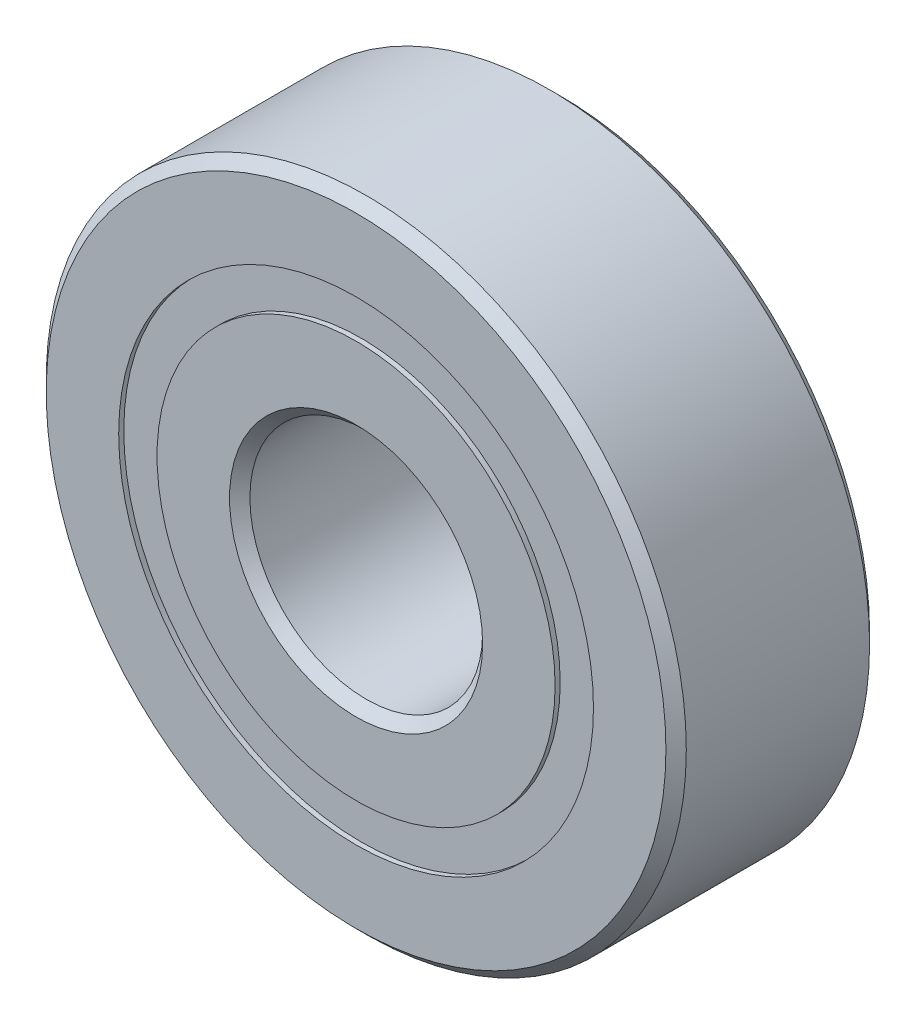
ISO-10303-21;
HEADER;
FILE_DESCRIPTION(('STEP AP214'),'2;1');
FILE_NAME('part.step','',(''),(''),'','','');
FILE_SCHEMA(('AUTOMOTIVE_DESIGN { 1 0 10303 214 1 1 1 1 }'));
ENDSEC;
DATA;
#1=APPLICATION_CONTEXT('core data for automotive mechanical design processes');
#2=APPLICATION_PROTOCOL_DEFINITION('international standard','automotive_design',2000,#1);
#3=PRODUCT_CONTEXT('',#1,'mechanical');
#4=PRODUCT('Part','Part','',(#3));
#5=PRODUCT_RELATED_PRODUCT_CATEGORY('part','',(#4));
#6=PRODUCT_DEFINITION_FORMATION('','',#4);
#7=PRODUCT_DEFINITION_CONTEXT('part definition',#1,'design');
#8=PRODUCT_DEFINITION('design','',#6,#7);
#9=PRODUCT_DEFINITION_SHAPE('','',#8);
#10=(LENGTH_UNIT() NAMED_UNIT(*) SI_UNIT(.MILLI.,.METRE.));
#11=(NAMED_UNIT(*) PLANE_ANGLE_UNIT() SI_UNIT($,.RADIAN.));
#12=(NAMED_UNIT(*) SI_UNIT($,.STERADIAN.) SOLID_ANGLE_UNIT());
#13=UNCERTAINTY_MEASURE_WITH_UNIT(LENGTH_MEASURE(1.E-05),#10,'distance_accuracy_value','');
#14=(GEOMETRIC_REPRESENTATION_CONTEXT(3) GLOBAL_UNCERTAINTY_ASSIGNED_CONTEXT((#13)) GLOBAL_UNIT_ASSIGNED_CONTEXT((#10,
#11,#12)) REPRESENTATION_CONTEXT('',''));
#15=CARTESIAN_POINT('',(0.,0.,0.));
#16=DIRECTION('',(0.,0.,1.));
#17=DIRECTION('',(1.,0.,0.));
#18=AXIS2_PLACEMENT_3D('',#15,#16,#17);
#19=CARTESIAN_POINT('',(0.,8.15934065934066,-3.325));
#20=DIRECTION('',(0.,0.,1.));
#21=DIRECTION('',(1.,0.,0.));
#22=AXIS2_PLACEMENT_3D('',#19,#20,#21);
#23=PLANE('',#22);
#24=CARTESIAN_POINT('',(0.,0.,-3.325));
#25=DIRECTION('',(0.,0.,1.));
#26=DIRECTION('',(1.,0.,0.));
#27=AXIS2_PLACEMENT_3D('',#24,#25,#26);
#28=CIRCLE('',#27,8.15934065934066);
#29=CARTESIAN_POINT('',(8.15934065934066,0.,-3.325));
#30=VERTEX_POINT('',#29);
#31=EDGE_CURVE('E69',#30,#30,#28,.T.);
#32=ORIENTED_EDGE('',*,*,#31,.F.);
#33=EDGE_LOOP('',(#32));
#34=FACE_BOUND('',#33,.T.);
#35=CARTESIAN_POINT('',(0.,0.,-3.325));
#36=DIRECTION('',(0.,0.,1.));
#37=DIRECTION('',(1.,0.,0.));
#38=AXIS2_PLACEMENT_3D('',#35,#36,#37);
#39=CIRCLE('',#38,6.84065934065934);
#40=CARTESIAN_POINT('',(6.84065934065934,0.,-3.325));
#41=VERTEX_POINT('',#40);
#42=EDGE_CURVE('E13',#41,#41,#39,.T.);
#43=ORIENTED_EDGE('',*,*,#42,.T.);
#44=EDGE_LOOP('',(#43));
#45=FACE_BOUND('',#44,.T.);
#46=ADVANCED_FACE('F55',(#34,#45),#23,.F.);
#47=CARTESIAN_POINT('',(0.,0.,3.5));
#48=DIRECTION('',(0.,0.,1.));
#49=DIRECTION('',(1.,0.,0.));
#50=AXIS2_PLACEMENT_3D('',#47,#48,#49);
#51=CYLINDRICAL_SURFACE('',#50,6.84065934065934);
#52=ORIENTED_EDGE('',*,*,#42,.F.);
#53=EDGE_LOOP('',(#52));
#54=FACE_BOUND('',#53,.T.);
#55=CARTESIAN_POINT('',(0.,0.,-1.68952158656808));
#56=DIRECTION('',(0.,0.,1.));
#57=DIRECTION('',(1.,0.,0.));
#58=AXIS2_PLACEMENT_3D('',#55,#56,#57);
#59=CIRCLE('',#58,6.84065934065934);
#60=CARTESIAN_POINT('',(6.84065934065934,0.,-1.68952158656808));
#61=VERTEX_POINT('',#60);
#62=EDGE_CURVE('E61',#61,#61,#59,.T.);
#63=ORIENTED_EDGE('',*,*,#62,.T.);
#64=EDGE_LOOP('',(#63));
#65=FACE_BOUND('',#64,.T.);
#66=ADVANCED_FACE('F78',(#54,#65),#51,.F.);
#67=CARTESIAN_POINT('',(0.,8.15934065934066,-1.68952158656808));
#68=DIRECTION('',(0.,0.,-1.));
#69=DIRECTION('',(-1.,0.,0.));
#70=AXIS2_PLACEMENT_3D('',#67,#68,#69);
#71=PLANE('',#70);
#72=ORIENTED_EDGE('',*,*,#62,.F.);
#73=EDGE_LOOP('',(#72));
#74=FACE_BOUND('',#73,.T.);
#75=CARTESIAN_POINT('',(0.,0.,-1.68952158656808));
#76=DIRECTION('',(0.,0.,1.));
#77=DIRECTION('',(1.,0.,0.));
#78=AXIS2_PLACEMENT_3D('',#75,#76,#77);
#79=CIRCLE('',#78,8.15934065934066);
#80=CARTESIAN_POINT('',(8.15934065934066,0.,-1.68952158656808));
#81=VERTEX_POINT('',#80);
#82=EDGE_CURVE('E65',#81,#81,#79,.T.);
#83=ORIENTED_EDGE('',*,*,#82,.T.);
#84=EDGE_LOOP('',(#83));
#85=FACE_BOUND('',#84,.T.);
#86=ADVANCED_FACE('F82',(#74,#85),#71,.F.);
#87=CARTESIAN_POINT('',(0.,0.,3.5));
#88=DIRECTION('',(0.,0.,1.));
#89=DIRECTION('',(1.,0.,0.));
#90=AXIS2_PLACEMENT_3D('',#87,#88,#89);
#91=CYLINDRICAL_SURFACE('',#90,8.15934065934066);
#92=ORIENTED_EDGE('',*,*,#82,.F.);
#93=EDGE_LOOP('',(#92));
#94=FACE_BOUND('',#93,.T.);
#95=ORIENTED_EDGE('',*,*,#31,.T.);
#96=EDGE_LOOP('',(#95));
#97=FACE_BOUND('',#96,.T.);
#98=ADVANCED_FACE('F75',(#94,#97),#91,.T.);
#99=CLOSED_SHELL('',(#46,#66,#86,#98));
#100=MANIFOLD_SOLID_BREP('B2',#99);
#101=CARTESIAN_POINT('',(0.,8.15934065934066,3.325));
#102=DIRECTION('',(0.,0.,-1.));
#103=DIRECTION('',(-1.,0.,0.));
#104=AXIS2_PLACEMENT_3D('',#101,#102,#103);
#105=PLANE('',#104);
#106=CARTESIAN_POINT('',(0.,0.,3.325));
#107=DIRECTION('',(0.,0.,1.));
#108=DIRECTION('',(1.,0.,0.));
#109=AXIS2_PLACEMENT_3D('',#106,#107,#108);
#110=CIRCLE('',#109,6.84065934065934);
#111=CARTESIAN_POINT('',(6.84065934065934,0.,3.325));
#112=VERTEX_POINT('',#111);
#113=EDGE_CURVE('E54',#112,#112,#110,.T.);
#114=ORIENTED_EDGE('',*,*,#113,.F.);
#115=EDGE_LOOP('',(#114));
#116=FACE_BOUND('',#115,.T.);
#117=CARTESIAN_POINT('',(0.,0.,3.325));
#118=DIRECTION('',(0.,0.,1.));
#119=DIRECTION('',(1.,0.,0.));
#120=AXIS2_PLACEMENT_3D('',#117,#118,#119);
#121=CIRCLE('',#120,8.15934065934066);
#122=CARTESIAN_POINT('',(8.15934065934066,0.,3.325));
#123=VERTEX_POINT('',#122);
#124=EDGE_CURVE('E143',#123,#123,#121,.T.);
#125=ORIENTED_EDGE('',*,*,#124,.T.);
#126=EDGE_LOOP('',(#125));
#127=FACE_BOUND('',#126,.T.);
#128=ADVANCED_FACE('F129',(#116,#127),#105,.F.);
#129=CARTESIAN_POINT('',(0.,0.,3.5));
#130=DIRECTION('',(0.,0.,1.));
#131=DIRECTION('',(1.,0.,0.));
#132=AXIS2_PLACEMENT_3D('',#129,#130,#131);
#133=CYLINDRICAL_SURFACE('',#132,6.84065934065934);
#134=CARTESIAN_POINT('',(0.,0.,1.68952158656808));
#135=DIRECTION('',(0.,0.,1.));
#136=DIRECTION('',(1.,0.,0.));
#137=AXIS2_PLACEMENT_3D('',#134,#135,#136);
#138=CIRCLE('',#137,6.84065934065934);
#139=CARTESIAN_POINT('',(6.84065934065934,0.,1.68952158656808));
#140=VERTEX_POINT('',#139);
#141=EDGE_CURVE('E135',#140,#140,#138,.T.);
#142=ORIENTED_EDGE('',*,*,#141,.F.);
#143=EDGE_LOOP('',(#142));
#144=FACE_BOUND('',#143,.T.);
#145=ORIENTED_EDGE('',*,*,#113,.T.);
#146=EDGE_LOOP('',(#145));
#147=FACE_BOUND('',#146,.T.);
#148=ADVANCED_FACE('F158',(#144,#147),#133,.F.);
#149=CARTESIAN_POINT('',(0.,8.15934065934066,1.68952158656808));
#150=DIRECTION('',(0.,0.,1.));
#151=DIRECTION('',(1.,0.,0.));
#152=AXIS2_PLACEMENT_3D('',#149,#150,#151);
#153=PLANE('',#152);
#154=CARTESIAN_POINT('',(0.,0.,1.68952158656808));
#155=DIRECTION('',(0.,0.,1.));
#156=DIRECTION('',(1.,0.,0.));
#157=AXIS2_PLACEMENT_3D('',#154,#155,#156);
#158=CIRCLE('',#157,8.15934065934066);
#159=CARTESIAN_POINT('',(8.15934065934066,0.,1.68952158656808));
#160=VERTEX_POINT('',#159);
#161=EDGE_CURVE('E139',#160,#160,#158,.T.);
#162=ORIENTED_EDGE('',*,*,#161,.F.);
#163=EDGE_LOOP('',(#162));
#164=FACE_BOUND('',#163,.T.);
#165=ORIENTED_EDGE('',*,*,#141,.T.);
#166=EDGE_LOOP('',(#165));
#167=FACE_BOUND('',#166,.T.);
#168=ADVANCED_FACE('F153',(#164,#167),#153,.F.);
#169=CARTESIAN_POINT('',(0.,0.,3.5));
#170=DIRECTION('',(0.,0.,1.));
#171=DIRECTION('',(1.,0.,0.));
#172=AXIS2_PLACEMENT_3D('',#169,#170,#171);
#173=CYLINDRICAL_SURFACE('',#172,8.15934065934066);
#174=ORIENTED_EDGE('',*,*,#124,.F.);
#175=EDGE_LOOP('',(#174));
#176=FACE_BOUND('',#175,.T.);
#177=ORIENTED_EDGE('',*,*,#161,.T.);
#178=EDGE_LOOP('',(#177));
#179=FACE_BOUND('',#178,.T.);
#180=ADVANCED_FACE('F150',(#176,#179),#173,.T.);
#181=CLOSED_SHELL('',(#128,#148,#168,#180));
#182=MANIFOLD_SOLID_BREP('B8',#181);
#183=CARTESIAN_POINT('',(-3.74999999999992,6.49519052838334,0.));
#184=DIRECTION('',(0.,0.,1.));
#185=DIRECTION('',(-0.499999999999989,0.866025403784445,0.));
#186=AXIS2_PLACEMENT_3D('',#183,#184,#185);
#187=SPHERICAL_SURFACE('',#186,1.68952158656808);
#188=CARTESIAN_POINT('',(-3.74999999999992,6.49519052838334,1.68952158656808));
#189=VERTEX_POINT('',#188);
#190=VERTEX_LOOP('',#189);
#191=FACE_BOUND('',#190,.T.);
#192=ADVANCED_FACE('F200',(#191),#187,.T.);
#193=CLOSED_SHELL('',(#192));
#194=MANIFOLD_SOLID_BREP('B49',#193);
#195=CARTESIAN_POINT('',(-6.49519052838325,3.75000000000008,0.));
#196=DIRECTION('',(0.,0.,1.));
#197=DIRECTION('',(-0.866025403784433,0.50000000000001,0.));
#198=AXIS2_PLACEMENT_3D('',#195,#196,#197);
#199=SPHERICAL_SURFACE('',#198,1.68952158656808);
#200=CARTESIAN_POINT('',(-6.49519052838325,3.75000000000008,1.68952158656808));
#201=VERTEX_POINT('',#200);
#202=VERTEX_LOOP('',#201);
#203=FACE_BOUND('',#202,.T.);
#204=ADVANCED_FACE('F224',(#203),#199,.T.);
#205=CLOSED_SHELL('',(#204));
#206=MANIFOLD_SOLID_BREP('B125',#205);
#207=CARTESIAN_POINT('',(-7.5,0.,0.));
#208=DIRECTION('',(0.,0.,1.));
#209=DIRECTION('',(-1.,0.,0.));
#210=AXIS2_PLACEMENT_3D('',#207,#208,#209);
#211=SPHERICAL_SURFACE('',#210,1.68952158656808);
#212=CARTESIAN_POINT('',(-7.5,0.,1.68952158656808));
#213=VERTEX_POINT('',#212);
#214=VERTEX_LOOP('',#213);
#215=FACE_BOUND('',#214,.T.);
#216=ADVANCED_FACE('F249',(#215),#211,.T.);
#217=CLOSED_SHELL('',(#216));
#218=MANIFOLD_SOLID_BREP('B196',#217);
#219=CARTESIAN_POINT('',(-6.49519052838332,-3.74999999999994,0.));
#220=DIRECTION('',(0.,0.,1.));
#221=DIRECTION('',(-0.866025403784443,-0.499999999999992,0.));
#222=AXIS2_PLACEMENT_3D('',#219,#220,#221);
#223=SPHERICAL_SURFACE('',#222,1.68952158656808);
#224=CARTESIAN_POINT('',(-6.49519052838332,-3.74999999999994,1.68952158656808));
#225=VERTEX_POINT('',#224);
#226=VERTEX_LOOP('',#225);
#227=FACE_BOUND('',#226,.T.);
#228=ADVANCED_FACE('F273',(#227),#223,.T.);
#229=CLOSED_SHELL('',(#228));
#230=MANIFOLD_SOLID_BREP('B220',#229);
#231=CARTESIAN_POINT('',(-3.75000000000005,-6.49519052838326,0.));
#232=DIRECTION('',(0.,0.,1.));
#233=DIRECTION('',(-0.500000000000007,-0.866025403784435,0.));
#234=AXIS2_PLACEMENT_3D('',#231,#232,#233);
#235=SPHERICAL_SURFACE('',#234,1.68952158656808);
#236=CARTESIAN_POINT('',(-3.75000000000005,-6.49519052838326,1.68952158656808));
#237=VERTEX_POINT('',#236);
#238=VERTEX_LOOP('',#237);
#239=FACE_BOUND('',#238,.T.);
#240=ADVANCED_FACE('F297',(#239),#235,.T.);
#241=CLOSED_SHELL('',(#240));
#242=MANIFOLD_SOLID_BREP('B245',#241);
#243=CARTESIAN_POINT('',(0.,-7.5,0.));
#244=DIRECTION('',(0.,0.,1.));
#245=DIRECTION('',(0.,-1.,0.));
#246=AXIS2_PLACEMENT_3D('',#243,#244,#245);
#247=SPHERICAL_SURFACE('',#246,1.68952158656808);
#248=CARTESIAN_POINT('',(0.,-7.5,1.68952158656808));
#249=VERTEX_POINT('',#248);
#250=VERTEX_LOOP('',#249);
#251=FACE_BOUND('',#250,.T.);
#252=ADVANCED_FACE('F322',(#251),#247,.T.);
#253=CLOSED_SHELL('',(#252));
#254=MANIFOLD_SOLID_BREP('B269',#253);
#255=CARTESIAN_POINT('',(3.74999999999996,-6.49519052838331,0.));
#256=DIRECTION('',(0.,0.,1.));
#257=DIRECTION('',(0.499999999999995,-0.866025403784442,0.));
#258=AXIS2_PLACEMENT_3D('',#255,#256,#257);
#259=SPHERICAL_SURFACE('',#258,1.68952158656808);
#260=CARTESIAN_POINT('',(3.74999999999996,-6.49519052838331,1.68952158656808));
#261=VERTEX_POINT('',#260);
#262=VERTEX_LOOP('',#261);
#263=FACE_BOUND('',#262,.T.);
#264=ADVANCED_FACE('F347',(#263),#259,.T.);
#265=CLOSED_SHELL('',(#264));
#266=MANIFOLD_SOLID_BREP('B293',#265);
#267=CARTESIAN_POINT('',(6.49519052838327,-3.75000000000003,0.));
#268=DIRECTION('',(0.,0.,1.));
#269=DIRECTION('',(0.866025403784436,-0.500000000000004,0.));
#270=AXIS2_PLACEMENT_3D('',#267,#268,#269);
#271=SPHERICAL_SURFACE('',#270,1.68952158656808);
#272=CARTESIAN_POINT('',(6.49519052838327,-3.75000000000003,1.68952158656808));
#273=VERTEX_POINT('',#272);
#274=VERTEX_LOOP('',#273);
#275=FACE_BOUND('',#274,.T.);
#276=ADVANCED_FACE('F372',(#275),#271,.T.);
#277=CLOSED_SHELL('',(#276));
#278=MANIFOLD_SOLID_BREP('B318',#277);
#279=CARTESIAN_POINT('',(7.5,0.,0.));
#280=DIRECTION('',(0.,0.,1.));
#281=DIRECTION('',(1.,0.,0.));
#282=AXIS2_PLACEMENT_3D('',#279,#280,#281);
#283=SPHERICAL_SURFACE('',#282,1.68952158656808);
#284=CARTESIAN_POINT('',(7.5,0.,1.68952158656808));
#285=VERTEX_POINT('',#284);
#286=VERTEX_LOOP('',#285);
#287=FACE_BOUND('',#286,.T.);
#288=ADVANCED_FACE('F396',(#287),#283,.T.);
#289=CLOSED_SHELL('',(#288));
#290=MANIFOLD_SOLID_BREP('B343',#289);
#291=CARTESIAN_POINT('',(6.4951905283833,3.74999999999998,0.));
#292=DIRECTION('',(0.,0.,1.));
#293=DIRECTION('',(0.86602540378444,0.499999999999998,0.));
#294=AXIS2_PLACEMENT_3D('',#291,#292,#293);
#295=SPHERICAL_SURFACE('',#294,1.68952158656808);
#296=CARTESIAN_POINT('',(6.4951905283833,3.74999999999998,1.68952158656808));
#297=VERTEX_POINT('',#296);
#298=VERTEX_LOOP('',#297);
#299=FACE_BOUND('',#298,.T.);
#300=ADVANCED_FACE('F420',(#299),#295,.T.);
#301=CLOSED_SHELL('',(#300));
#302=MANIFOLD_SOLID_BREP('B368',#301);
#303=CARTESIAN_POINT('',(3.75000000000001,6.49519052838328,0.));
#304=DIRECTION('',(0.,0.,1.));
#305=DIRECTION('',(0.500000000000001,0.866025403784438,0.));
#306=AXIS2_PLACEMENT_3D('',#303,#304,#305);
#307=SPHERICAL_SURFACE('',#306,1.68952158656808);
#308=CARTESIAN_POINT('',(3.75000000000001,6.49519052838328,1.68952158656808));
#309=VERTEX_POINT('',#308);
#310=VERTEX_LOOP('',#309);
#311=FACE_BOUND('',#310,.T.);
#312=ADVANCED_FACE('F445',(#311),#307,.T.);
#313=CLOSED_SHELL('',(#312));
#314=MANIFOLD_SOLID_BREP('B392',#313);
#315=CARTESIAN_POINT('',(0.,7.5,0.));
#316=DIRECTION('',(0.,0.,1.));
#317=DIRECTION('',(0.,1.,0.));
#318=AXIS2_PLACEMENT_3D('',#315,#316,#317);
#319=SPHERICAL_SURFACE('',#318,1.68952158656808);
#320=CARTESIAN_POINT('',(0.,7.5,1.68952158656808));
#321=VERTEX_POINT('',#320);
#322=VERTEX_LOOP('',#321);
#323=FACE_BOUND('',#322,.T.);
#324=ADVANCED_FACE('F473',(#323),#319,.T.);
#325=CLOSED_SHELL('',(#324));
#326=MANIFOLD_SOLID_BREP('B416',#325);
#327=CARTESIAN_POINT('',(0.,6.84065934065934,3.5));
#328=DIRECTION('',(0.,0.,-1.));
#329=DIRECTION('',(-1.,0.,0.));
#330=AXIS2_PLACEMENT_3D('',#327,#328,#329);
#331=PLANE('',#330);
#332=CARTESIAN_POINT('',(0.,0.,3.5));
#333=DIRECTION('',(0.,0.,1.));
#334=DIRECTION('',(1.,0.,0.));
#335=AXIS2_PLACEMENT_3D('',#332,#333,#334);
#336=CIRCLE('',#335,4.35);
#337=CARTESIAN_POINT('',(4.35,0.,3.5));
#338=VERTEX_POINT('',#337);
#339=EDGE_CURVE('E528',#338,#338,#336,.T.);
#340=ORIENTED_EDGE('',*,*,#339,.F.);
#341=EDGE_LOOP('',(#340));
#342=FACE_BOUND('',#341,.T.);
#343=CARTESIAN_POINT('',(0.,0.,3.5));
#344=DIRECTION('',(0.,0.,1.));
#345=DIRECTION('',(1.,0.,0.));
#346=AXIS2_PLACEMENT_3D('',#343,#344,#345);
#347=CIRCLE('',#346,6.84065934065934);
#348=CARTESIAN_POINT('',(6.84065934065934,0.,3.5));
#349=VERTEX_POINT('',#348);
#350=EDGE_CURVE('E472',#349,#349,#347,.T.);
#351=ORIENTED_EDGE('',*,*,#350,.T.);
#352=EDGE_LOOP('',(#351));
#353=FACE_BOUND('',#352,.T.);
#354=ADVANCED_FACE('F500',(#342,#353),#331,.F.);
#355=CARTESIAN_POINT('',(0.,0.,3.5));
#356=DIRECTION('',(0.,0.,1.));
#357=DIRECTION('',(1.,0.,0.));
#358=AXIS2_PLACEMENT_3D('',#355,#356,#357);
#359=CYLINDRICAL_SURFACE('',#358,6.84065934065934);
#360=ORIENTED_EDGE('',*,*,#350,.F.);
#361=EDGE_LOOP('',(#360));
#362=FACE_BOUND('',#361,.T.);
#363=CARTESIAN_POINT('',(0.,0.,1.55555555555556));
#364=DIRECTION('',(0.,0.,1.));
#365=DIRECTION('',(1.,0.,0.));
#366=AXIS2_PLACEMENT_3D('',#363,#364,#365);
#367=CIRCLE('',#366,6.84065934065934);
#368=CARTESIAN_POINT('',(6.84065934065934,0.,1.55555555555556));
#369=VERTEX_POINT('',#368);
#370=EDGE_CURVE('E506',#369,#369,#367,.T.);
#371=ORIENTED_EDGE('',*,*,#370,.T.);
#372=EDGE_LOOP('',(#371));
#373=FACE_BOUND('',#372,.T.);
#374=ADVANCED_FACE('F535',(#362,#373),#359,.T.);
#375=CARTESIAN_POINT('',(0.,0.,0.));
#376=DIRECTION('',(0.,0.,1.));
#377=DIRECTION('',(1.,0.,0.));
#378=AXIS2_PLACEMENT_3D('',#375,#376,#377);
#379=TOROIDAL_SURFACE('',#378,7.49999999999999,1.68952158656808);
#380=ORIENTED_EDGE('',*,*,#370,.F.);
#381=EDGE_LOOP('',(#380));
#382=FACE_BOUND('',#381,.T.);
#383=CARTESIAN_POINT('',(0.,0.,-1.55555555555556));
#384=DIRECTION('',(0.,0.,1.));
#385=DIRECTION('',(1.,0.,0.));
#386=AXIS2_PLACEMENT_3D('',#383,#384,#385);
#387=CIRCLE('',#386,6.84065934065934);
#388=CARTESIAN_POINT('',(6.84065934065934,0.,-1.55555555555556));
#389=VERTEX_POINT('',#388);
#390=EDGE_CURVE('E510',#389,#389,#387,.T.);
#391=ORIENTED_EDGE('',*,*,#390,.T.);
#392=EDGE_LOOP('',(#391));
#393=FACE_BOUND('',#392,.T.);
#394=ADVANCED_FACE('F539',(#382,#393),#379,.F.);
#395=CARTESIAN_POINT('',(0.,0.,3.5));
#396=DIRECTION('',(0.,0.,1.));
#397=DIRECTION('',(1.,0.,0.));
#398=AXIS2_PLACEMENT_3D('',#395,#396,#397);
#399=CYLINDRICAL_SURFACE('',#398,6.84065934065934);
#400=ORIENTED_EDGE('',*,*,#390,.F.);
#401=EDGE_LOOP('',(#400));
#402=FACE_BOUND('',#401,.T.);
#403=CARTESIAN_POINT('',(0.,0.,-3.5));
#404=DIRECTION('',(0.,0.,1.));
#405=DIRECTION('',(1.,0.,0.));
#406=AXIS2_PLACEMENT_3D('',#403,#404,#405);
#407=CIRCLE('',#406,6.84065934065934);
#408=CARTESIAN_POINT('',(6.84065934065934,0.,-3.5));
#409=VERTEX_POINT('',#408);
#410=EDGE_CURVE('E514',#409,#409,#407,.T.);
#411=ORIENTED_EDGE('',*,*,#410,.T.);
#412=EDGE_LOOP('',(#411));
#413=FACE_BOUND('',#412,.T.);
#414=ADVANCED_FACE('F544',(#402,#413),#399,.T.);
#415=CARTESIAN_POINT('',(0.,4.35,-3.5));
#416=DIRECTION('',(0.,0.,1.));
#417=DIRECTION('',(1.,0.,0.));
#418=AXIS2_PLACEMENT_3D('',#415,#416,#417);
#419=PLANE('',#418);
#420=ORIENTED_EDGE('',*,*,#410,.F.);
#421=EDGE_LOOP('',(#420));
#422=FACE_BOUND('',#421,.T.);
#423=CARTESIAN_POINT('',(0.,0.,-3.5));
#424=DIRECTION('',(0.,0.,1.));
#425=DIRECTION('',(1.,0.,0.));
#426=AXIS2_PLACEMENT_3D('',#423,#424,#425);
#427=CIRCLE('',#426,4.35);
#428=CARTESIAN_POINT('',(4.35,0.,-3.5));
#429=VERTEX_POINT('',#428);
#430=EDGE_CURVE('E519',#429,#429,#427,.T.);
#431=ORIENTED_EDGE('',*,*,#430,.T.);
#432=EDGE_LOOP('',(#431));
#433=FACE_BOUND('',#432,.T.);
#434=ADVANCED_FACE('F550',(#422,#433),#419,.F.);
#435=CARTESIAN_POINT('',(0.,0.,-3.15));
#436=DIRECTION('',(0.,0.,-1.));
#437=DIRECTION('',(-1.,0.,0.));
#438=AXIS2_PLACEMENT_3D('',#435,#436,#437);
#439=CONICAL_SURFACE('',#438,4.,0.78539816339745);
#440=ORIENTED_EDGE('',*,*,#430,.F.);
#441=EDGE_LOOP('',(#440));
#442=FACE_BOUND('',#441,.T.);
#443=CARTESIAN_POINT('',(0.,0.,-3.15));
#444=DIRECTION('',(0.,0.,1.));
#445=DIRECTION('',(1.,0.,0.));
#446=AXIS2_PLACEMENT_3D('',#443,#444,#445);
#447=CIRCLE('',#446,4.);
#448=CARTESIAN_POINT('',(4.,0.,-3.15));
#449=VERTEX_POINT('',#448);
#450=EDGE_CURVE('E522',#449,#449,#447,.T.);
#451=ORIENTED_EDGE('',*,*,#450,.T.);
#452=EDGE_LOOP('',(#451));
#453=FACE_BOUND('',#452,.T.);
#454=ADVANCED_FACE('F554',(#442,#453),#439,.F.);
#455=CARTESIAN_POINT('',(0.,0.,3.5));
#456=DIRECTION('',(0.,0.,1.));
#457=DIRECTION('',(1.,0.,0.));
#458=AXIS2_PLACEMENT_3D('',#455,#456,#457);
#459=CYLINDRICAL_SURFACE('',#458,4.);
#460=ORIENTED_EDGE('',*,*,#450,.F.);
#461=EDGE_LOOP('',(#460));
#462=FACE_BOUND('',#461,.T.);
#463=CARTESIAN_POINT('',(0.,0.,3.15));
#464=DIRECTION('',(0.,0.,1.));
#465=DIRECTION('',(1.,0.,0.));
#466=AXIS2_PLACEMENT_3D('',#463,#464,#465);
#467=CIRCLE('',#466,4.);
#468=CARTESIAN_POINT('',(4.,0.,3.15));
#469=VERTEX_POINT('',#468);
#470=EDGE_CURVE('E525',#469,#469,#467,.T.);
#471=ORIENTED_EDGE('',*,*,#470,.T.);
#472=EDGE_LOOP('',(#471));
#473=FACE_BOUND('',#472,.T.);
#474=ADVANCED_FACE('F558',(#462,#473),#459,.F.);
#475=CARTESIAN_POINT('',(0.,0.,3.5));
#476=DIRECTION('',(0.,0.,1.));
#477=DIRECTION('',(1.,0.,0.));
#478=AXIS2_PLACEMENT_3D('',#475,#476,#477);
#479=CONICAL_SURFACE('',#478,4.35,0.785398163397448);
#480=ORIENTED_EDGE('',*,*,#470,.F.);
#481=EDGE_LOOP('',(#480));
#482=FACE_BOUND('',#481,.T.);
#483=ORIENTED_EDGE('',*,*,#339,.T.);
#484=EDGE_LOOP('',(#483));
#485=FACE_BOUND('',#484,.T.);
#486=ADVANCED_FACE('F532',(#482,#485),#479,.F.);
#487=CLOSED_SHELL('',(#354,#374,#394,#414,#434,#454,#474,#486));
#488=MANIFOLD_SOLID_BREP('B441',#487);
#489=CARTESIAN_POINT('',(0.,0.,3.15));
#490=DIRECTION('',(0.,0.,-1.));
#491=DIRECTION('',(-1.,0.,0.));
#492=AXIS2_PLACEMENT_3D('',#489,#490,#491);
#493=CONICAL_SURFACE('',#492,11.,0.785398163397448);
#494=CARTESIAN_POINT('',(0.,0.,3.5));
#495=DIRECTION('',(0.,0.,1.));
#496=DIRECTION('',(1.,0.,0.));
#497=AXIS2_PLACEMENT_3D('',#494,#495,#496);
#498=CIRCLE('',#497,10.65);
#499=CARTESIAN_POINT('',(10.65,0.,3.5));
#500=VERTEX_POINT('',#499);
#501=EDGE_CURVE('E655',#500,#500,#498,.T.);
#502=ORIENTED_EDGE('',*,*,#501,.F.);
#503=EDGE_LOOP('',(#502));
#504=FACE_BOUND('',#503,.T.);
#505=CARTESIAN_POINT('',(0.,0.,3.15));
#506=DIRECTION('',(0.,0.,1.));
#507=DIRECTION('',(1.,0.,0.));
#508=AXIS2_PLACEMENT_3D('',#505,#506,#507);
#509=CIRCLE('',#508,11.);
#510=CARTESIAN_POINT('',(11.,0.,3.15));
#511=VERTEX_POINT('',#510);
#512=EDGE_CURVE('E499',#511,#511,#509,.T.);
#513=ORIENTED_EDGE('',*,*,#512,.T.);
#514=EDGE_LOOP('',(#513));
#515=FACE_BOUND('',#514,.T.);
#516=ADVANCED_FACE('F627',(#504,#515),#493,.T.);
#517=CARTESIAN_POINT('',(0.,0.,3.5));
#518=DIRECTION('',(0.,0.,1.));
#519=DIRECTION('',(1.,0.,0.));
#520=AXIS2_PLACEMENT_3D('',#517,#518,#519);
#521=CYLINDRICAL_SURFACE('',#520,11.);
#522=ORIENTED_EDGE('',*,*,#512,.F.);
#523=EDGE_LOOP('',(#522));
#524=FACE_BOUND('',#523,.T.);
#525=CARTESIAN_POINT('',(0.,0.,-3.15));
#526=DIRECTION('',(0.,0.,1.));
#527=DIRECTION('',(1.,0.,0.));
#528=AXIS2_PLACEMENT_3D('',#525,#526,#527);
#529=CIRCLE('',#528,11.);
#530=CARTESIAN_POINT('',(11.,0.,-3.15));
#531=VERTEX_POINT('',#530);
#532=EDGE_CURVE('E633',#531,#531,#529,.T.);
#533=ORIENTED_EDGE('',*,*,#532,.T.);
#534=EDGE_LOOP('',(#533));
#535=FACE_BOUND('',#534,.T.);
#536=ADVANCED_FACE('F662',(#524,#535),#521,.T.);
#537=CARTESIAN_POINT('',(0.,0.,-3.5));
#538=DIRECTION('',(0.,0.,1.));
#539=DIRECTION('',(1.,0.,0.));
#540=AXIS2_PLACEMENT_3D('',#537,#538,#539);
#541=CONICAL_SURFACE('',#540,10.65,0.785398163397448);
#542=ORIENTED_EDGE('',*,*,#532,.F.);
#543=EDGE_LOOP('',(#542));
#544=FACE_BOUND('',#543,.T.);
#545=CARTESIAN_POINT('',(0.,0.,-3.5));
#546=DIRECTION('',(0.,0.,1.));
#547=DIRECTION('',(1.,0.,0.));
#548=AXIS2_PLACEMENT_3D('',#545,#546,#547);
#549=CIRCLE('',#548,10.65);
#550=CARTESIAN_POINT('',(10.65,0.,-3.5));
#551=VERTEX_POINT('',#550);
#552=EDGE_CURVE('E637',#551,#551,#549,.T.);
#553=ORIENTED_EDGE('',*,*,#552,.T.);
#554=EDGE_LOOP('',(#553));
#555=FACE_BOUND('',#554,.T.);
#556=ADVANCED_FACE('F666',(#544,#555),#541,.T.);
#557=CARTESIAN_POINT('',(0.,10.65,-3.5));
#558=DIRECTION('',(0.,0.,1.));
#559=DIRECTION('',(1.,0.,0.));
#560=AXIS2_PLACEMENT_3D('',#557,#558,#559);
#561=PLANE('',#560);
#562=ORIENTED_EDGE('',*,*,#552,.F.);
#563=EDGE_LOOP('',(#562));
#564=FACE_BOUND('',#563,.T.);
#565=CARTESIAN_POINT('',(0.,0.,-3.5));
#566=DIRECTION('',(0.,0.,1.));
#567=DIRECTION('',(1.,0.,0.));
#568=AXIS2_PLACEMENT_3D('',#565,#566,#567);
#569=CIRCLE('',#568,8.15934065934066);
#570=CARTESIAN_POINT('',(8.15934065934066,0.,-3.5));
#571=VERTEX_POINT('',#570);
#572=EDGE_CURVE('E641',#571,#571,#569,.T.);
#573=ORIENTED_EDGE('',*,*,#572,.T.);
#574=EDGE_LOOP('',(#573));
#575=FACE_BOUND('',#574,.T.);
#576=ADVANCED_FACE('F671',(#564,#575),#561,.F.);
#577=CARTESIAN_POINT('',(0.,0.,3.5));
#578=DIRECTION('',(0.,0.,1.));
#579=DIRECTION('',(1.,0.,0.));
#580=AXIS2_PLACEMENT_3D('',#577,#578,#579);
#581=CYLINDRICAL_SURFACE('',#580,8.15934065934066);
#582=ORIENTED_EDGE('',*,*,#572,.F.);
#583=EDGE_LOOP('',(#582));
#584=FACE_BOUND('',#583,.T.);
#585=CARTESIAN_POINT('',(0.,0.,-1.55555555555556));
#586=DIRECTION('',(0.,0.,1.));
#587=DIRECTION('',(1.,0.,0.));
#588=AXIS2_PLACEMENT_3D('',#585,#586,#587);
#589=CIRCLE('',#588,8.15934065934066);
#590=CARTESIAN_POINT('',(8.15934065934066,0.,-1.55555555555556));
#591=VERTEX_POINT('',#590);
#592=EDGE_CURVE('E646',#591,#591,#589,.T.);
#593=ORIENTED_EDGE('',*,*,#592,.T.);
#594=EDGE_LOOP('',(#593));
#595=FACE_BOUND('',#594,.T.);
#596=ADVANCED_FACE('F677',(#584,#595),#581,.F.);
#597=CARTESIAN_POINT('',(0.,0.,0.));
#598=DIRECTION('',(0.,0.,1.));
#599=DIRECTION('',(1.,0.,0.));
#600=AXIS2_PLACEMENT_3D('',#597,#598,#599);
#601=TOROIDAL_SURFACE('',#600,7.5,1.68952158656808);
#602=ORIENTED_EDGE('',*,*,#592,.F.);
#603=EDGE_LOOP('',(#602));
#604=FACE_BOUND('',#603,.T.);
#605=CARTESIAN_POINT('',(0.,0.,1.55555555555555));
#606=DIRECTION('',(0.,0.,1.));
#607=DIRECTION('',(1.,0.,0.));
#608=AXIS2_PLACEMENT_3D('',#605,#606,#607);
#609=CIRCLE('',#608,8.15934065934066);
#610=CARTESIAN_POINT('',(8.15934065934066,0.,1.55555555555555));
#611=VERTEX_POINT('',#610);
#612=EDGE_CURVE('E649',#611,#611,#609,.T.);
#613=ORIENTED_EDGE('',*,*,#612,.T.);
#614=EDGE_LOOP('',(#613));
#615=FACE_BOUND('',#614,.T.);
#616=ADVANCED_FACE('F681',(#604,#615),#601,.F.);
#617=CARTESIAN_POINT('',(0.,0.,3.5));
#618=DIRECTION('',(0.,0.,1.));
#619=DIRECTION('',(1.,0.,0.));
#620=AXIS2_PLACEMENT_3D('',#617,#618,#619);
#621=CYLINDRICAL_SURFACE('',#620,8.15934065934066);
#622=ORIENTED_EDGE('',*,*,#612,.F.);
#623=EDGE_LOOP('',(#622));
#624=FACE_BOUND('',#623,.T.);
#625=CARTESIAN_POINT('',(0.,0.,3.5));
#626=DIRECTION('',(0.,0.,1.));
#627=DIRECTION('',(1.,0.,0.));
#628=AXIS2_PLACEMENT_3D('',#625,#626,#627);
#629=CIRCLE('',#628,8.15934065934066);
#630=CARTESIAN_POINT('',(8.15934065934066,0.,3.5));
#631=VERTEX_POINT('',#630);
#632=EDGE_CURVE('E652',#631,#631,#629,.T.);
#633=ORIENTED_EDGE('',*,*,#632,.T.);
#634=EDGE_LOOP('',(#633));
#635=FACE_BOUND('',#634,.T.);
#636=ADVANCED_FACE('F685',(#624,#635),#621,.F.);
#637=CARTESIAN_POINT('',(0.,10.65,3.5));
#638=DIRECTION('',(0.,0.,-1.));
#639=DIRECTION('',(-1.,0.,0.));
#640=AXIS2_PLACEMENT_3D('',#637,#638,#639);
#641=PLANE('',#640);
#642=ORIENTED_EDGE('',*,*,#632,.F.);
#643=EDGE_LOOP('',(#642));
#644=FACE_BOUND('',#643,.T.);
#645=ORIENTED_EDGE('',*,*,#501,.T.);
#646=EDGE_LOOP('',(#645));
#647=FACE_BOUND('',#646,.T.);
#648=ADVANCED_FACE('F659',(#644,#647),#641,.F.);
#649=CLOSED_SHELL('',(#516,#536,#556,#576,#596,#616,#636,#648));
#650=MANIFOLD_SOLID_BREP('B467',#649);
#651=ADVANCED_BREP_SHAPE_REPRESENTATION('',(#18,#100,#182,#194,#206,#218,#230,#242,#254,#266,
#278,#290,#302,#314,#326,#488,#650),#14);
#652=SHAPE_DEFINITION_REPRESENTATION(#9,#651);
ENDSEC;
END-ISO-10303-21;
